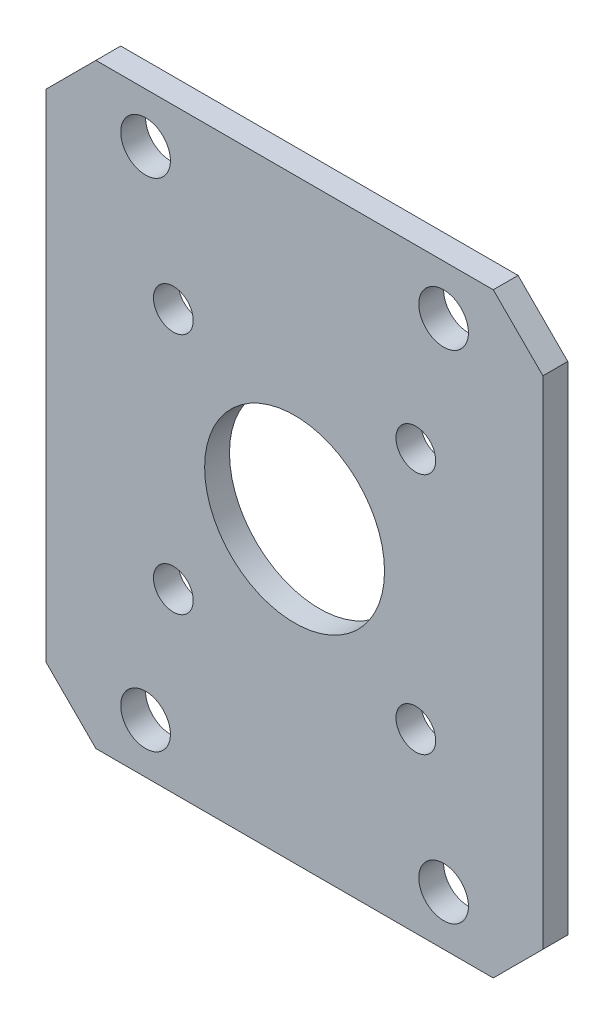
ISO-10303-21;
HEADER;
FILE_DESCRIPTION(('STEP AP214'),'2;1');
FILE_NAME('part.step','',(''),(''),'','','');
FILE_SCHEMA(('AUTOMOTIVE_DESIGN { 1 0 10303 214 1 1 1 1 }'));
ENDSEC;
DATA;
#1=APPLICATION_CONTEXT('core data for automotive mechanical design processes');
#2=APPLICATION_PROTOCOL_DEFINITION('international standard','automotive_design',2000,#1);
#3=PRODUCT_CONTEXT('',#1,'mechanical');
#4=PRODUCT('Part','Part','',(#3));
#5=PRODUCT_RELATED_PRODUCT_CATEGORY('part','',(#4));
#6=PRODUCT_DEFINITION_FORMATION('','',#4);
#7=PRODUCT_DEFINITION_CONTEXT('part definition',#1,'design');
#8=PRODUCT_DEFINITION('design','',#6,#7);
#9=PRODUCT_DEFINITION_SHAPE('','',#8);
#10=(LENGTH_UNIT() NAMED_UNIT(*) SI_UNIT(.MILLI.,.METRE.));
#11=(NAMED_UNIT(*) PLANE_ANGLE_UNIT() SI_UNIT($,.RADIAN.));
#12=(NAMED_UNIT(*) SI_UNIT($,.STERADIAN.) SOLID_ANGLE_UNIT());
#13=UNCERTAINTY_MEASURE_WITH_UNIT(LENGTH_MEASURE(1.E-05),#10,'distance_accuracy_value','');
#14=(GEOMETRIC_REPRESENTATION_CONTEXT(3) GLOBAL_UNCERTAINTY_ASSIGNED_CONTEXT((#13)) GLOBAL_UNIT_ASSIGNED_CONTEXT((#10,
#11,#12)) REPRESENTATION_CONTEXT('',''));
#15=CARTESIAN_POINT('',(0.,0.,0.));
#16=DIRECTION('',(0.,0.,1.));
#17=DIRECTION('',(1.,0.,0.));
#18=AXIS2_PLACEMENT_3D('',#15,#16,#17);
#19=CARTESIAN_POINT('',(31.75,-38.1,1.5875));
#20=DIRECTION('',(-1.,0.,0.));
#21=DIRECTION('',(0.,0.,1.));
#22=AXIS2_PLACEMENT_3D('',#19,#20,#21);
#23=PLANE('',#22);
#24=DIRECTION('',(0.,1.,0.));
#25=VECTOR('',#24,1.);
#26=CARTESIAN_POINT('',(31.75,-38.1,1.5875));
#27=LINE('',#26,#25);
#28=CARTESIAN_POINT('',(31.75,-31.75,1.5875));
#29=VERTEX_POINT('',#28);
#30=CARTESIAN_POINT('',(31.75,31.75,1.5875));
#31=VERTEX_POINT('',#30);
#32=EDGE_CURVE('E129',#29,#31,#27,.T.);
#33=ORIENTED_EDGE('',*,*,#32,.F.);
#34=DIRECTION('',(0.,0.,-1.));
#35=VECTOR('',#34,1.);
#36=CARTESIAN_POINT('',(31.75,-31.75,1.5875));
#37=LINE('',#36,#35);
#38=CARTESIAN_POINT('',(31.75,-31.75,-1.5875));
#39=VERTEX_POINT('',#38);
#40=EDGE_CURVE('E155',#29,#39,#37,.T.);
#41=ORIENTED_EDGE('',*,*,#40,.T.);
#42=DIRECTION('',(0.,1.,0.));
#43=VECTOR('',#42,1.);
#44=CARTESIAN_POINT('',(31.75,-38.1,-1.5875));
#45=LINE('',#44,#43);
#46=CARTESIAN_POINT('',(31.75,31.75,-1.5875));
#47=VERTEX_POINT('',#46);
#48=EDGE_CURVE('E161',#39,#47,#45,.T.);
#49=ORIENTED_EDGE('',*,*,#48,.T.);
#50=DIRECTION('',(0.,0.,1.));
#51=VECTOR('',#50,1.);
#52=CARTESIAN_POINT('',(31.75,31.75,1.5875));
#53=LINE('',#52,#51);
#54=EDGE_CURVE('E153',#47,#31,#53,.T.);
#55=ORIENTED_EDGE('',*,*,#54,.T.);
#56=EDGE_LOOP('',(#33,#41,#49,#55));
#57=FACE_BOUND('',#56,.T.);
#58=ADVANCED_FACE('F36',(#57),#23,.F.);
#59=CARTESIAN_POINT('',(-31.75,38.1,1.5875));
#60=DIRECTION('',(0.,-1.,0.));
#61=DIRECTION('',(0.,0.,-1.));
#62=AXIS2_PLACEMENT_3D('',#59,#60,#61);
#63=PLANE('',#62);
#64=DIRECTION('',(-1.,0.,0.));
#65=VECTOR('',#64,1.);
#66=CARTESIAN_POINT('',(-31.75,38.1,1.5875));
#67=LINE('',#66,#65);
#68=CARTESIAN_POINT('',(25.4,38.1,1.5875));
#69=VERTEX_POINT('',#68);
#70=CARTESIAN_POINT('',(-25.4,38.1,1.5875));
#71=VERTEX_POINT('',#70);
#72=EDGE_CURVE('E132',#69,#71,#67,.T.);
#73=ORIENTED_EDGE('',*,*,#72,.F.);
#74=DIRECTION('',(0.,0.,-1.));
#75=VECTOR('',#74,1.);
#76=CARTESIAN_POINT('',(25.4,38.1,1.5875));
#77=LINE('',#76,#75);
#78=CARTESIAN_POINT('',(25.4,38.1,-1.5875));
#79=VERTEX_POINT('',#78);
#80=EDGE_CURVE('E11',#69,#79,#77,.T.);
#81=ORIENTED_EDGE('',*,*,#80,.T.);
#82=DIRECTION('',(-1.,0.,0.));
#83=VECTOR('',#82,1.);
#84=CARTESIAN_POINT('',(-31.75,38.1,-1.5875));
#85=LINE('',#84,#83);
#86=CARTESIAN_POINT('',(-25.4,38.1,-1.5875));
#87=VERTEX_POINT('',#86);
#88=EDGE_CURVE('E134',#79,#87,#85,.T.);
#89=ORIENTED_EDGE('',*,*,#88,.T.);
#90=DIRECTION('',(0.,0.,1.));
#91=VECTOR('',#90,1.);
#92=CARTESIAN_POINT('',(-25.4,38.1,1.5875));
#93=LINE('',#92,#91);
#94=EDGE_CURVE('E45',#87,#71,#93,.T.);
#95=ORIENTED_EDGE('',*,*,#94,.T.);
#96=EDGE_LOOP('',(#73,#81,#89,#95));
#97=FACE_BOUND('',#96,.T.);
#98=ADVANCED_FACE('F261',(#97),#63,.F.);
#99=CARTESIAN_POINT('',(-31.75,-38.1,1.5875));
#100=DIRECTION('',(1.,0.,0.));
#101=DIRECTION('',(0.,0.,-1.));
#102=AXIS2_PLACEMENT_3D('',#99,#100,#101);
#103=PLANE('',#102);
#104=DIRECTION('',(0.,-1.,0.));
#105=VECTOR('',#104,1.);
#106=CARTESIAN_POINT('',(-31.75,-38.1,-1.5875));
#107=LINE('',#106,#105);
#108=CARTESIAN_POINT('',(-31.75,31.75,-1.5875));
#109=VERTEX_POINT('',#108);
#110=CARTESIAN_POINT('',(-31.75,-31.75,-1.5875));
#111=VERTEX_POINT('',#110);
#112=EDGE_CURVE('E130',#109,#111,#107,.T.);
#113=ORIENTED_EDGE('',*,*,#112,.T.);
#114=DIRECTION('',(0.,0.,1.));
#115=VECTOR('',#114,1.);
#116=CARTESIAN_POINT('',(-31.75,-31.75,1.5875));
#117=LINE('',#116,#115);
#118=CARTESIAN_POINT('',(-31.75,-31.75,1.5875));
#119=VERTEX_POINT('',#118);
#120=EDGE_CURVE('E108',#111,#119,#117,.T.);
#121=ORIENTED_EDGE('',*,*,#120,.T.);
#122=DIRECTION('',(0.,-1.,0.));
#123=VECTOR('',#122,1.);
#124=CARTESIAN_POINT('',(-31.75,-38.1,1.5875));
#125=LINE('',#124,#123);
#126=CARTESIAN_POINT('',(-31.75,31.75,1.5875));
#127=VERTEX_POINT('',#126);
#128=EDGE_CURVE('E173',#127,#119,#125,.T.);
#129=ORIENTED_EDGE('',*,*,#128,.F.);
#130=DIRECTION('',(0.,0.,-1.));
#131=VECTOR('',#130,1.);
#132=CARTESIAN_POINT('',(-31.75,31.75,1.5875));
#133=LINE('',#132,#131);
#134=EDGE_CURVE('E113',#127,#109,#133,.T.);
#135=ORIENTED_EDGE('',*,*,#134,.T.);
#136=EDGE_LOOP('',(#113,#121,#129,#135));
#137=FACE_BOUND('',#136,.T.);
#138=ADVANCED_FACE('F259',(#137),#103,.F.);
#139=CARTESIAN_POINT('',(-31.75,-38.1,1.5875));
#140=DIRECTION('',(0.,1.,0.));
#141=DIRECTION('',(0.,0.,1.));
#142=AXIS2_PLACEMENT_3D('',#139,#140,#141);
#143=PLANE('',#142);
#144=DIRECTION('',(1.,0.,0.));
#145=VECTOR('',#144,1.);
#146=CARTESIAN_POINT('',(-31.75,-38.1,1.5875));
#147=LINE('',#146,#145);
#148=CARTESIAN_POINT('',(-25.4,-38.1,1.5875));
#149=VERTEX_POINT('',#148);
#150=CARTESIAN_POINT('',(25.4,-38.1,1.5875));
#151=VERTEX_POINT('',#150);
#152=EDGE_CURVE('E123',#149,#151,#147,.T.);
#153=ORIENTED_EDGE('',*,*,#152,.F.);
#154=DIRECTION('',(0.,0.,-1.));
#155=VECTOR('',#154,1.);
#156=CARTESIAN_POINT('',(-25.4,-38.1,1.5875));
#157=LINE('',#156,#155);
#158=CARTESIAN_POINT('',(-25.4,-38.1,-1.5875));
#159=VERTEX_POINT('',#158);
#160=EDGE_CURVE('E107',#149,#159,#157,.T.);
#161=ORIENTED_EDGE('',*,*,#160,.T.);
#162=DIRECTION('',(1.,0.,0.));
#163=VECTOR('',#162,1.);
#164=CARTESIAN_POINT('',(-31.75,-38.1,-1.5875));
#165=LINE('',#164,#163);
#166=CARTESIAN_POINT('',(25.4,-38.1,-1.5875));
#167=VERTEX_POINT('',#166);
#168=EDGE_CURVE('E120',#159,#167,#165,.T.);
#169=ORIENTED_EDGE('',*,*,#168,.T.);
#170=DIRECTION('',(0.,0.,1.));
#171=VECTOR('',#170,1.);
#172=CARTESIAN_POINT('',(25.4,-38.1,1.5875));
#173=LINE('',#172,#171);
#174=EDGE_CURVE('E125',#167,#151,#173,.T.);
#175=ORIENTED_EDGE('',*,*,#174,.T.);
#176=EDGE_LOOP('',(#153,#161,#169,#175));
#177=FACE_BOUND('',#176,.T.);
#178=ADVANCED_FACE('F119',(#177),#143,.F.);
#179=CARTESIAN_POINT('',(0.,0.,1.5875));
#180=DIRECTION('',(0.,0.,-1.));
#181=DIRECTION('',(-1.,0.,0.));
#182=AXIS2_PLACEMENT_3D('',#179,#180,#181);
#183=PLANE('',#182);
#184=CARTESIAN_POINT('',(0.,0.,1.5875));
#185=DIRECTION('',(0.,0.,1.));
#186=DIRECTION('',(1.,0.,0.));
#187=AXIS2_PLACEMENT_3D('',#184,#185,#186);
#188=CIRCLE('',#187,11.5);
#189=CARTESIAN_POINT('',(11.5,0.,1.5875));
#190=VERTEX_POINT('',#189);
#191=EDGE_CURVE('E222',#190,#190,#188,.T.);
#192=ORIENTED_EDGE('',*,*,#191,.F.);
#193=EDGE_LOOP('',(#192));
#194=FACE_BOUND('',#193,.T.);
#195=CARTESIAN_POINT('',(-15.5,-15.5,1.5875));
#196=DIRECTION('',(0.,0.,1.));
#197=DIRECTION('',(1.,0.,0.));
#198=AXIS2_PLACEMENT_3D('',#195,#196,#197);
#199=CIRCLE('',#198,2.54);
#200=CARTESIAN_POINT('',(-12.96,-15.5,1.5875));
#201=VERTEX_POINT('',#200);
#202=EDGE_CURVE('E204',#201,#201,#199,.T.);
#203=ORIENTED_EDGE('',*,*,#202,.F.);
#204=EDGE_LOOP('',(#203));
#205=FACE_BOUND('',#204,.T.);
#206=CARTESIAN_POINT('',(15.5,-15.5,1.5875));
#207=DIRECTION('',(0.,0.,1.));
#208=DIRECTION('',(1.,0.,0.));
#209=AXIS2_PLACEMENT_3D('',#206,#207,#208);
#210=CIRCLE('',#209,2.54);
#211=CARTESIAN_POINT('',(18.04,-15.5,1.5875));
#212=VERTEX_POINT('',#211);
#213=EDGE_CURVE('E211',#212,#212,#210,.T.);
#214=ORIENTED_EDGE('',*,*,#213,.F.);
#215=EDGE_LOOP('',(#214));
#216=FACE_BOUND('',#215,.T.);
#217=CARTESIAN_POINT('',(15.5,15.5,1.5875));
#218=DIRECTION('',(0.,0.,1.));
#219=DIRECTION('',(1.,0.,0.));
#220=AXIS2_PLACEMENT_3D('',#217,#218,#219);
#221=CIRCLE('',#220,2.54);
#222=CARTESIAN_POINT('',(18.04,15.5,1.5875));
#223=VERTEX_POINT('',#222);
#224=EDGE_CURVE('E217',#223,#223,#221,.T.);
#225=ORIENTED_EDGE('',*,*,#224,.F.);
#226=EDGE_LOOP('',(#225));
#227=FACE_BOUND('',#226,.T.);
#228=CARTESIAN_POINT('',(-15.5,15.5,1.5875));
#229=DIRECTION('',(0.,0.,1.));
#230=DIRECTION('',(1.,0.,0.));
#231=AXIS2_PLACEMENT_3D('',#228,#229,#230);
#232=CIRCLE('',#231,2.54);
#233=CARTESIAN_POINT('',(-12.96,15.5,1.5875));
#234=VERTEX_POINT('',#233);
#235=EDGE_CURVE('E198',#234,#234,#232,.T.);
#236=ORIENTED_EDGE('',*,*,#235,.F.);
#237=EDGE_LOOP('',(#236));
#238=FACE_BOUND('',#237,.T.);
#239=CARTESIAN_POINT('',(-19.05,-31.75,1.5875));
#240=DIRECTION('',(0.,0.,1.));
#241=DIRECTION('',(1.,0.,0.));
#242=AXIS2_PLACEMENT_3D('',#239,#240,#241);
#243=CIRCLE('',#242,3.175);
#244=CARTESIAN_POINT('',(-15.875,-31.75,1.5875));
#245=VERTEX_POINT('',#244);
#246=EDGE_CURVE('E180',#245,#245,#243,.T.);
#247=ORIENTED_EDGE('',*,*,#246,.F.);
#248=EDGE_LOOP('',(#247));
#249=FACE_BOUND('',#248,.T.);
#250=CARTESIAN_POINT('',(19.05,-31.75,1.5875));
#251=DIRECTION('',(0.,0.,1.));
#252=DIRECTION('',(1.,0.,0.));
#253=AXIS2_PLACEMENT_3D('',#250,#251,#252);
#254=CIRCLE('',#253,3.175);
#255=CARTESIAN_POINT('',(22.225,-31.75,1.5875));
#256=VERTEX_POINT('',#255);
#257=EDGE_CURVE('E187',#256,#256,#254,.T.);
#258=ORIENTED_EDGE('',*,*,#257,.F.);
#259=EDGE_LOOP('',(#258));
#260=FACE_BOUND('',#259,.T.);
#261=CARTESIAN_POINT('',(19.05,31.75,1.5875));
#262=DIRECTION('',(0.,0.,1.));
#263=DIRECTION('',(1.,0.,0.));
#264=AXIS2_PLACEMENT_3D('',#261,#262,#263);
#265=CIRCLE('',#264,3.175);
#266=CARTESIAN_POINT('',(22.225,31.75,1.5875));
#267=VERTEX_POINT('',#266);
#268=EDGE_CURVE('E193',#267,#267,#265,.T.);
#269=ORIENTED_EDGE('',*,*,#268,.F.);
#270=EDGE_LOOP('',(#269));
#271=FACE_BOUND('',#270,.T.);
#272=CARTESIAN_POINT('',(-19.05,31.75,1.5875));
#273=DIRECTION('',(0.,0.,1.));
#274=DIRECTION('',(1.,0.,0.));
#275=AXIS2_PLACEMENT_3D('',#272,#273,#274);
#276=CIRCLE('',#275,3.175);
#277=CARTESIAN_POINT('',(-15.875,31.75,1.5875));
#278=VERTEX_POINT('',#277);
#279=EDGE_CURVE('E169',#278,#278,#276,.T.);
#280=ORIENTED_EDGE('',*,*,#279,.F.);
#281=EDGE_LOOP('',(#280));
#282=FACE_BOUND('',#281,.T.);
#283=ORIENTED_EDGE('',*,*,#128,.T.);
#284=DIRECTION('',(-0.707106781186547,0.707106781186548,0.));
#285=VECTOR('',#284,1.);
#286=CARTESIAN_POINT('',(-25.4,-38.1,1.5875));
#287=LINE('',#286,#285);
#288=EDGE_CURVE('E151',#119,#149,#287,.F.);
#289=ORIENTED_EDGE('',*,*,#288,.T.);
#290=ORIENTED_EDGE('',*,*,#152,.T.);
#291=DIRECTION('',(-0.707106781186548,-0.707106781186547,0.));
#292=VECTOR('',#291,1.);
#293=CARTESIAN_POINT('',(31.75,-31.75,1.5875));
#294=LINE('',#293,#292);
#295=EDGE_CURVE('E149',#151,#29,#294,.F.);
#296=ORIENTED_EDGE('',*,*,#295,.T.);
#297=ORIENTED_EDGE('',*,*,#32,.T.);
#298=DIRECTION('',(0.707106781186547,-0.707106781186548,0.));
#299=VECTOR('',#298,1.);
#300=CARTESIAN_POINT('',(25.4,38.1,1.5875));
#301=LINE('',#300,#299);
#302=EDGE_CURVE('E58',#31,#69,#301,.F.);
#303=ORIENTED_EDGE('',*,*,#302,.T.);
#304=ORIENTED_EDGE('',*,*,#72,.T.);
#305=DIRECTION('',(0.707106781186548,0.707106781186547,0.));
#306=VECTOR('',#305,1.);
#307=CARTESIAN_POINT('',(-31.75,31.75,1.5875));
#308=LINE('',#307,#306);
#309=EDGE_CURVE('E146',#71,#127,#308,.F.);
#310=ORIENTED_EDGE('',*,*,#309,.T.);
#311=EDGE_LOOP('',(#283,#289,#290,#296,#297,#303,#304,#310));
#312=FACE_BOUND('',#311,.T.);
#313=ADVANCED_FACE('F236',(#194,#205,#216,#227,#238,#249,#260,#271,#282,#312),#183,.F.);
#314=CARTESIAN_POINT('',(0.,0.,-1.5875));
#315=DIRECTION('',(0.,0.,-1.));
#316=DIRECTION('',(-1.,0.,0.));
#317=AXIS2_PLACEMENT_3D('',#314,#315,#316);
#318=PLANE('',#317);
#319=CARTESIAN_POINT('',(0.,0.,-1.5875));
#320=DIRECTION('',(0.,0.,1.));
#321=DIRECTION('',(1.,0.,0.));
#322=AXIS2_PLACEMENT_3D('',#319,#320,#321);
#323=CIRCLE('',#322,11.5);
#324=CARTESIAN_POINT('',(11.5,0.,-1.5875));
#325=VERTEX_POINT('',#324);
#326=EDGE_CURVE('E208',#325,#325,#323,.T.);
#327=ORIENTED_EDGE('',*,*,#326,.T.);
#328=EDGE_LOOP('',(#327));
#329=FACE_BOUND('',#328,.T.);
#330=CARTESIAN_POINT('',(-15.5,-15.5,-1.5875));
#331=DIRECTION('',(0.,0.,1.));
#332=DIRECTION('',(1.,0.,0.));
#333=AXIS2_PLACEMENT_3D('',#330,#331,#332);
#334=CIRCLE('',#333,2.54);
#335=CARTESIAN_POINT('',(-12.96,-15.5,-1.5875));
#336=VERTEX_POINT('',#335);
#337=EDGE_CURVE('E207',#336,#336,#334,.T.);
#338=ORIENTED_EDGE('',*,*,#337,.T.);
#339=EDGE_LOOP('',(#338));
#340=FACE_BOUND('',#339,.T.);
#341=CARTESIAN_POINT('',(15.5,-15.5,-1.5875));
#342=DIRECTION('',(0.,0.,1.));
#343=DIRECTION('',(1.,0.,0.));
#344=AXIS2_PLACEMENT_3D('',#341,#342,#343);
#345=CIRCLE('',#344,2.54);
#346=CARTESIAN_POINT('',(18.04,-15.5,-1.5875));
#347=VERTEX_POINT('',#346);
#348=EDGE_CURVE('E214',#347,#347,#345,.T.);
#349=ORIENTED_EDGE('',*,*,#348,.T.);
#350=EDGE_LOOP('',(#349));
#351=FACE_BOUND('',#350,.T.);
#352=CARTESIAN_POINT('',(15.5,15.5,-1.5875));
#353=DIRECTION('',(0.,0.,1.));
#354=DIRECTION('',(1.,0.,0.));
#355=AXIS2_PLACEMENT_3D('',#352,#353,#354);
#356=CIRCLE('',#355,2.54);
#357=CARTESIAN_POINT('',(18.04,15.5,-1.5875));
#358=VERTEX_POINT('',#357);
#359=EDGE_CURVE('E201',#358,#358,#356,.T.);
#360=ORIENTED_EDGE('',*,*,#359,.T.);
#361=EDGE_LOOP('',(#360));
#362=FACE_BOUND('',#361,.T.);
#363=CARTESIAN_POINT('',(-15.5,15.5,-1.5875));
#364=DIRECTION('',(0.,0.,1.));
#365=DIRECTION('',(1.,0.,0.));
#366=AXIS2_PLACEMENT_3D('',#363,#364,#365);
#367=CIRCLE('',#366,2.54);
#368=CARTESIAN_POINT('',(-12.96,15.5,-1.5875));
#369=VERTEX_POINT('',#368);
#370=EDGE_CURVE('E184',#369,#369,#367,.T.);
#371=ORIENTED_EDGE('',*,*,#370,.T.);
#372=EDGE_LOOP('',(#371));
#373=FACE_BOUND('',#372,.T.);
#374=CARTESIAN_POINT('',(-19.05,-31.75,-1.5875));
#375=DIRECTION('',(0.,0.,1.));
#376=DIRECTION('',(1.,0.,0.));
#377=AXIS2_PLACEMENT_3D('',#374,#375,#376);
#378=CIRCLE('',#377,3.175);
#379=CARTESIAN_POINT('',(-15.875,-31.75,-1.5875));
#380=VERTEX_POINT('',#379);
#381=EDGE_CURVE('E183',#380,#380,#378,.T.);
#382=ORIENTED_EDGE('',*,*,#381,.T.);
#383=EDGE_LOOP('',(#382));
#384=FACE_BOUND('',#383,.T.);
#385=CARTESIAN_POINT('',(19.05,-31.75,-1.5875));
#386=DIRECTION('',(0.,0.,1.));
#387=DIRECTION('',(1.,0.,0.));
#388=AXIS2_PLACEMENT_3D('',#385,#386,#387);
#389=CIRCLE('',#388,3.175);
#390=CARTESIAN_POINT('',(22.225,-31.75,-1.5875));
#391=VERTEX_POINT('',#390);
#392=EDGE_CURVE('E190',#391,#391,#389,.T.);
#393=ORIENTED_EDGE('',*,*,#392,.T.);
#394=EDGE_LOOP('',(#393));
#395=FACE_BOUND('',#394,.T.);
#396=CARTESIAN_POINT('',(19.05,31.75,-1.5875));
#397=DIRECTION('',(0.,0.,1.));
#398=DIRECTION('',(1.,0.,0.));
#399=AXIS2_PLACEMENT_3D('',#396,#397,#398);
#400=CIRCLE('',#399,3.175);
#401=CARTESIAN_POINT('',(22.225,31.75,-1.5875));
#402=VERTEX_POINT('',#401);
#403=EDGE_CURVE('E178',#402,#402,#400,.T.);
#404=ORIENTED_EDGE('',*,*,#403,.T.);
#405=EDGE_LOOP('',(#404));
#406=FACE_BOUND('',#405,.T.);
#407=CARTESIAN_POINT('',(-19.05,31.75,-1.5875));
#408=DIRECTION('',(0.,0.,1.));
#409=DIRECTION('',(1.,0.,0.));
#410=AXIS2_PLACEMENT_3D('',#407,#408,#409);
#411=CIRCLE('',#410,3.175);
#412=CARTESIAN_POINT('',(-15.875,31.75,-1.5875));
#413=VERTEX_POINT('',#412);
#414=EDGE_CURVE('E166',#413,#413,#411,.T.);
#415=ORIENTED_EDGE('',*,*,#414,.T.);
#416=EDGE_LOOP('',(#415));
#417=FACE_BOUND('',#416,.T.);
#418=ORIENTED_EDGE('',*,*,#168,.F.);
#419=DIRECTION('',(0.707106781186547,-0.707106781186548,0.));
#420=VECTOR('',#419,1.);
#421=CARTESIAN_POINT('',(-31.75,-31.75,-1.5875));
#422=LINE('',#421,#420);
#423=EDGE_CURVE('E103',#159,#111,#422,.F.);
#424=ORIENTED_EDGE('',*,*,#423,.T.);
#425=ORIENTED_EDGE('',*,*,#112,.F.);
#426=DIRECTION('',(-0.707106781186548,-0.707106781186547,0.));
#427=VECTOR('',#426,1.);
#428=CARTESIAN_POINT('',(-31.75,31.75,-1.5875));
#429=LINE('',#428,#427);
#430=EDGE_CURVE('E124',#109,#87,#429,.F.);
#431=ORIENTED_EDGE('',*,*,#430,.T.);
#432=ORIENTED_EDGE('',*,*,#88,.F.);
#433=DIRECTION('',(-0.707106781186547,0.707106781186548,0.));
#434=VECTOR('',#433,1.);
#435=CARTESIAN_POINT('',(31.75,31.75,-1.5875));
#436=LINE('',#435,#434);
#437=EDGE_CURVE('E140',#79,#47,#436,.F.);
#438=ORIENTED_EDGE('',*,*,#437,.T.);
#439=ORIENTED_EDGE('',*,*,#48,.F.);
#440=DIRECTION('',(0.707106781186548,0.707106781186547,0.));
#441=VECTOR('',#440,1.);
#442=CARTESIAN_POINT('',(31.75,-31.75,-1.5875));
#443=LINE('',#442,#441);
#444=EDGE_CURVE('E114',#39,#167,#443,.F.);
#445=ORIENTED_EDGE('',*,*,#444,.T.);
#446=EDGE_LOOP('',(#418,#424,#425,#431,#432,#438,#439,#445));
#447=FACE_BOUND('',#446,.T.);
#448=ADVANCED_FACE('F127',(#329,#340,#351,#362,#373,#384,#395,#406,#417,#447),#318,.T.);
#449=CARTESIAN_POINT('',(-19.05,31.75,-1.5875));
#450=DIRECTION('',(0.,0.,1.));
#451=DIRECTION('',(1.,0.,0.));
#452=AXIS2_PLACEMENT_3D('',#449,#450,#451);
#453=CYLINDRICAL_SURFACE('',#452,3.175);
#454=ORIENTED_EDGE('',*,*,#414,.F.);
#455=EDGE_LOOP('',(#454));
#456=FACE_BOUND('',#455,.T.);
#457=ORIENTED_EDGE('',*,*,#279,.T.);
#458=EDGE_LOOP('',(#457));
#459=FACE_BOUND('',#458,.T.);
#460=ADVANCED_FACE('F297',(#456,#459),#453,.F.);
#461=CARTESIAN_POINT('',(19.05,31.75,-1.5875));
#462=DIRECTION('',(0.,0.,1.));
#463=DIRECTION('',(1.,0.,0.));
#464=AXIS2_PLACEMENT_3D('',#461,#462,#463);
#465=CYLINDRICAL_SURFACE('',#464,3.175);
#466=ORIENTED_EDGE('',*,*,#403,.F.);
#467=EDGE_LOOP('',(#466));
#468=FACE_BOUND('',#467,.T.);
#469=ORIENTED_EDGE('',*,*,#268,.T.);
#470=EDGE_LOOP('',(#469));
#471=FACE_BOUND('',#470,.T.);
#472=ADVANCED_FACE('F301',(#468,#471),#465,.F.);
#473=CARTESIAN_POINT('',(19.05,-31.75,-1.5875));
#474=DIRECTION('',(0.,0.,1.));
#475=DIRECTION('',(1.,0.,0.));
#476=AXIS2_PLACEMENT_3D('',#473,#474,#475);
#477=CYLINDRICAL_SURFACE('',#476,3.175);
#478=ORIENTED_EDGE('',*,*,#392,.F.);
#479=EDGE_LOOP('',(#478));
#480=FACE_BOUND('',#479,.T.);
#481=ORIENTED_EDGE('',*,*,#257,.T.);
#482=EDGE_LOOP('',(#481));
#483=FACE_BOUND('',#482,.T.);
#484=ADVANCED_FACE('F307',(#480,#483),#477,.F.);
#485=CARTESIAN_POINT('',(-19.05,-31.75,-1.5875));
#486=DIRECTION('',(0.,0.,1.));
#487=DIRECTION('',(1.,0.,0.));
#488=AXIS2_PLACEMENT_3D('',#485,#486,#487);
#489=CYLINDRICAL_SURFACE('',#488,3.175);
#490=ORIENTED_EDGE('',*,*,#381,.F.);
#491=EDGE_LOOP('',(#490));
#492=FACE_BOUND('',#491,.T.);
#493=ORIENTED_EDGE('',*,*,#246,.T.);
#494=EDGE_LOOP('',(#493));
#495=FACE_BOUND('',#494,.T.);
#496=ADVANCED_FACE('F303',(#492,#495),#489,.F.);
#497=CARTESIAN_POINT('',(-15.5,15.5,-1.5875));
#498=DIRECTION('',(0.,0.,1.));
#499=DIRECTION('',(1.,0.,0.));
#500=AXIS2_PLACEMENT_3D('',#497,#498,#499);
#501=CYLINDRICAL_SURFACE('',#500,2.54);
#502=ORIENTED_EDGE('',*,*,#370,.F.);
#503=EDGE_LOOP('',(#502));
#504=FACE_BOUND('',#503,.T.);
#505=ORIENTED_EDGE('',*,*,#235,.T.);
#506=EDGE_LOOP('',(#505));
#507=FACE_BOUND('',#506,.T.);
#508=ADVANCED_FACE('F306',(#504,#507),#501,.F.);
#509=CARTESIAN_POINT('',(15.5,15.5,-1.5875));
#510=DIRECTION('',(0.,0.,1.));
#511=DIRECTION('',(1.,0.,0.));
#512=AXIS2_PLACEMENT_3D('',#509,#510,#511);
#513=CYLINDRICAL_SURFACE('',#512,2.54);
#514=ORIENTED_EDGE('',*,*,#359,.F.);
#515=EDGE_LOOP('',(#514));
#516=FACE_BOUND('',#515,.T.);
#517=ORIENTED_EDGE('',*,*,#224,.T.);
#518=EDGE_LOOP('',(#517));
#519=FACE_BOUND('',#518,.T.);
#520=ADVANCED_FACE('F317',(#516,#519),#513,.F.);
#521=CARTESIAN_POINT('',(15.5,-15.5,-1.5875));
#522=DIRECTION('',(0.,0.,1.));
#523=DIRECTION('',(1.,0.,0.));
#524=AXIS2_PLACEMENT_3D('',#521,#522,#523);
#525=CYLINDRICAL_SURFACE('',#524,2.54);
#526=ORIENTED_EDGE('',*,*,#348,.F.);
#527=EDGE_LOOP('',(#526));
#528=FACE_BOUND('',#527,.T.);
#529=ORIENTED_EDGE('',*,*,#213,.T.);
#530=EDGE_LOOP('',(#529));
#531=FACE_BOUND('',#530,.T.);
#532=ADVANCED_FACE('F321',(#528,#531),#525,.F.);
#533=CARTESIAN_POINT('',(-15.5,-15.5,-1.5875));
#534=DIRECTION('',(0.,0.,1.));
#535=DIRECTION('',(1.,0.,0.));
#536=AXIS2_PLACEMENT_3D('',#533,#534,#535);
#537=CYLINDRICAL_SURFACE('',#536,2.54);
#538=ORIENTED_EDGE('',*,*,#337,.F.);
#539=EDGE_LOOP('',(#538));
#540=FACE_BOUND('',#539,.T.);
#541=ORIENTED_EDGE('',*,*,#202,.T.);
#542=EDGE_LOOP('',(#541));
#543=FACE_BOUND('',#542,.T.);
#544=ADVANCED_FACE('F272',(#540,#543),#537,.F.);
#545=CARTESIAN_POINT('',(-25.4,-38.1,1.5875));
#546=DIRECTION('',(0.707106781186548,0.707106781186547,0.));
#547=DIRECTION('',(0.,0.,-1.));
#548=AXIS2_PLACEMENT_3D('',#545,#546,#547);
#549=PLANE('',#548);
#550=ORIENTED_EDGE('',*,*,#288,.F.);
#551=ORIENTED_EDGE('',*,*,#120,.F.);
#552=ORIENTED_EDGE('',*,*,#423,.F.);
#553=ORIENTED_EDGE('',*,*,#160,.F.);
#554=EDGE_LOOP('',(#550,#551,#552,#553));
#555=FACE_BOUND('',#554,.T.);
#556=ADVANCED_FACE('F106',(#555),#549,.F.);
#557=CARTESIAN_POINT('',(31.75,-31.75,1.5875));
#558=DIRECTION('',(-0.707106781186547,0.707106781186548,0.));
#559=DIRECTION('',(0.,0.,-1.));
#560=AXIS2_PLACEMENT_3D('',#557,#558,#559);
#561=PLANE('',#560);
#562=ORIENTED_EDGE('',*,*,#295,.F.);
#563=ORIENTED_EDGE('',*,*,#174,.F.);
#564=ORIENTED_EDGE('',*,*,#444,.F.);
#565=ORIENTED_EDGE('',*,*,#40,.F.);
#566=EDGE_LOOP('',(#562,#563,#564,#565));
#567=FACE_BOUND('',#566,.T.);
#568=ADVANCED_FACE('F265',(#567),#561,.F.);
#569=CARTESIAN_POINT('',(25.4,38.1,1.5875));
#570=DIRECTION('',(-0.707106781186548,-0.707106781186547,0.));
#571=DIRECTION('',(0.,0.,-1.));
#572=AXIS2_PLACEMENT_3D('',#569,#570,#571);
#573=PLANE('',#572);
#574=ORIENTED_EDGE('',*,*,#302,.F.);
#575=ORIENTED_EDGE('',*,*,#54,.F.);
#576=ORIENTED_EDGE('',*,*,#437,.F.);
#577=ORIENTED_EDGE('',*,*,#80,.F.);
#578=EDGE_LOOP('',(#574,#575,#576,#577));
#579=FACE_BOUND('',#578,.T.);
#580=ADVANCED_FACE('F264',(#579),#573,.F.);
#581=CARTESIAN_POINT('',(-31.75,31.75,1.5875));
#582=DIRECTION('',(0.707106781186547,-0.707106781186548,0.));
#583=DIRECTION('',(0.,0.,-1.));
#584=AXIS2_PLACEMENT_3D('',#581,#582,#583);
#585=PLANE('',#584);
#586=ORIENTED_EDGE('',*,*,#309,.F.);
#587=ORIENTED_EDGE('',*,*,#94,.F.);
#588=ORIENTED_EDGE('',*,*,#430,.F.);
#589=ORIENTED_EDGE('',*,*,#134,.F.);
#590=EDGE_LOOP('',(#586,#587,#588,#589));
#591=FACE_BOUND('',#590,.T.);
#592=ADVANCED_FACE('F39',(#591),#585,.F.);
#593=CARTESIAN_POINT('',(0.,0.,-1.5875));
#594=DIRECTION('',(0.,0.,1.));
#595=DIRECTION('',(1.,0.,0.));
#596=AXIS2_PLACEMENT_3D('',#593,#594,#595);
#597=CYLINDRICAL_SURFACE('',#596,11.5);
#598=ORIENTED_EDGE('',*,*,#326,.F.);
#599=EDGE_LOOP('',(#598));
#600=FACE_BOUND('',#599,.T.);
#601=ORIENTED_EDGE('',*,*,#191,.T.);
#602=EDGE_LOOP('',(#601));
#603=FACE_BOUND('',#602,.T.);
#604=ADVANCED_FACE('F230',(#600,#603),#597,.F.);
#605=CLOSED_SHELL('',(#58,#98,#138,#178,#313,#448,#460,#472,#484,#496,#508,#520,#532,#544,#556,
#568,#580,#592,#604));
#606=MANIFOLD_SOLID_BREP('B2',#605);
#607=ADVANCED_BREP_SHAPE_REPRESENTATION('',(#18,#606),#14);
#608=SHAPE_DEFINITION_REPRESENTATION(#9,#607);
ENDSEC;
END-ISO-10303-21;
